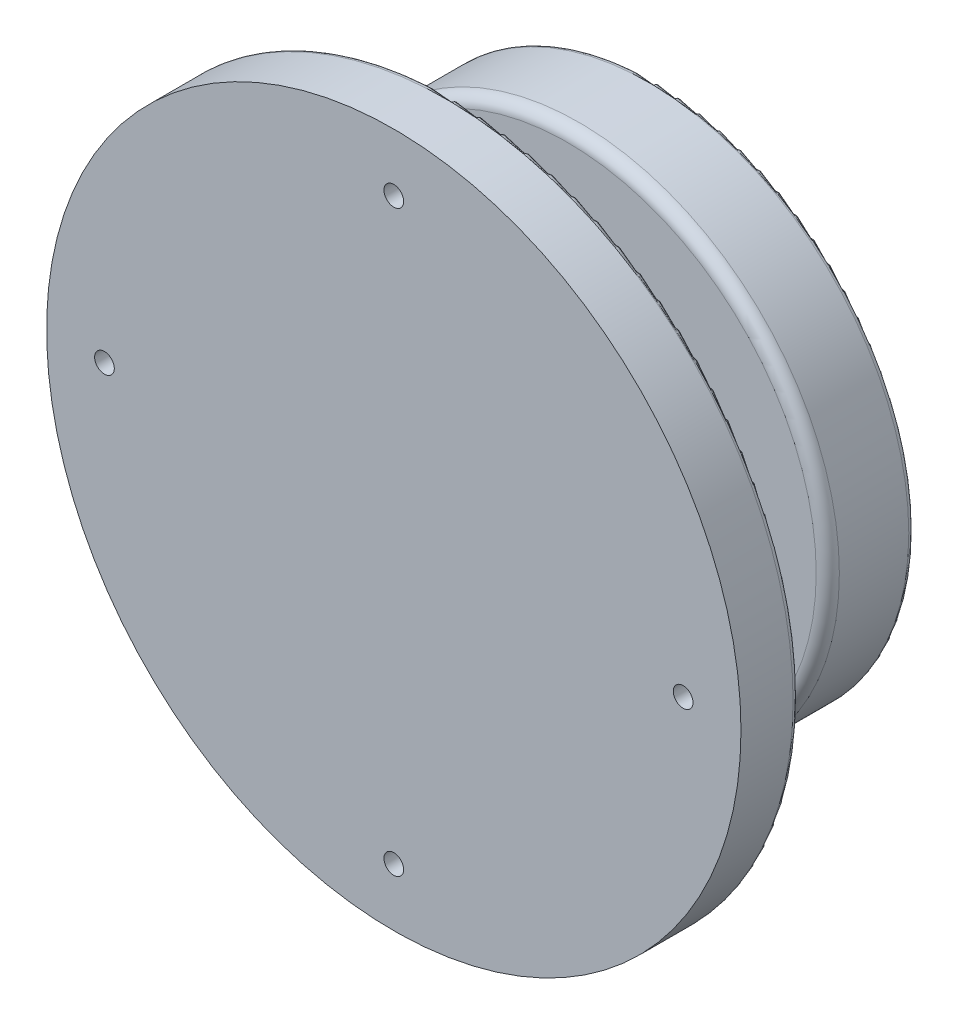
ISO-10303-21;
HEADER;
FILE_DESCRIPTION(('STEP AP214'),'2;1');
FILE_NAME('part.step','',(''),(''),'','','');
FILE_SCHEMA(('AUTOMOTIVE_DESIGN { 1 0 10303 214 1 1 1 1 }'));
ENDSEC;
DATA;
#1=APPLICATION_CONTEXT('core data for automotive mechanical design processes');
#2=APPLICATION_PROTOCOL_DEFINITION('international standard','automotive_design',2000,#1);
#3=PRODUCT_CONTEXT('',#1,'mechanical');
#4=PRODUCT('Part','Part','',(#3));
#5=PRODUCT_RELATED_PRODUCT_CATEGORY('part','',(#4));
#6=PRODUCT_DEFINITION_FORMATION('','',#4);
#7=PRODUCT_DEFINITION_CONTEXT('part definition',#1,'design');
#8=PRODUCT_DEFINITION('design','',#6,#7);
#9=PRODUCT_DEFINITION_SHAPE('','',#8);
#10=(LENGTH_UNIT() NAMED_UNIT(*) SI_UNIT(.MILLI.,.METRE.));
#11=(NAMED_UNIT(*) PLANE_ANGLE_UNIT() SI_UNIT($,.RADIAN.));
#12=(NAMED_UNIT(*) SI_UNIT($,.STERADIAN.) SOLID_ANGLE_UNIT());
#13=UNCERTAINTY_MEASURE_WITH_UNIT(LENGTH_MEASURE(1.E-05),#10,'distance_accuracy_value','');
#14=(GEOMETRIC_REPRESENTATION_CONTEXT(3) GLOBAL_UNCERTAINTY_ASSIGNED_CONTEXT((#13)) GLOBAL_UNIT_ASSIGNED_CONTEXT((#10,
#11,#12)) REPRESENTATION_CONTEXT('',''));
#15=CARTESIAN_POINT('',(0.,0.,0.));
#16=DIRECTION('',(0.,0.,1.));
#17=DIRECTION('',(1.,0.,0.));
#18=AXIS2_PLACEMENT_3D('',#15,#16,#17);
#19=CARTESIAN_POINT('',(0.,0.,15.));
#20=DIRECTION('',(0.,0.,1.));
#21=DIRECTION('',(1.,0.,0.));
#22=AXIS2_PLACEMENT_3D('',#19,#20,#21);
#23=PLANE('',#22);
#24=CARTESIAN_POINT('',(0.,0.,15.));
#25=DIRECTION('',(0.,0.,1.));
#26=DIRECTION('',(1.,0.,0.));
#27=AXIS2_PLACEMENT_3D('',#24,#25,#26);
#28=CIRCLE('',#27,43.);
#29=CARTESIAN_POINT('',(43.,0.,15.));
#30=VERTEX_POINT('',#29);
#31=EDGE_CURVE('E82',#30,#30,#28,.T.);
#32=ORIENTED_EDGE('',*,*,#31,.T.);
#33=EDGE_LOOP('',(#32));
#34=FACE_BOUND('',#33,.T.);
#35=CARTESIAN_POINT('',(0.,0.,15.));
#36=DIRECTION('',(0.,0.,1.));
#37=DIRECTION('',(1.,0.,0.));
#38=AXIS2_PLACEMENT_3D('',#35,#36,#37);
#39=CIRCLE('',#38,10.);
#40=CARTESIAN_POINT('',(10.,0.,15.));
#41=VERTEX_POINT('',#40);
#42=EDGE_CURVE('E78',#41,#41,#39,.T.);
#43=ORIENTED_EDGE('',*,*,#42,.F.);
#44=EDGE_LOOP('',(#43));
#45=FACE_BOUND('',#44,.T.);
#46=ADVANCED_FACE('F38',(#34,#45),#23,.T.);
#47=CARTESIAN_POINT('',(0.,0.,15.));
#48=DIRECTION('',(0.,0.,-1.));
#49=DIRECTION('',(-1.,0.,0.));
#50=AXIS2_PLACEMENT_3D('',#47,#48,#49);
#51=CYLINDRICAL_SURFACE('',#50,45.);
#52=CARTESIAN_POINT('',(0.,0.,1.));
#53=DIRECTION('',(0.,0.,1.));
#54=DIRECTION('',(1.,0.,0.));
#55=AXIS2_PLACEMENT_3D('',#52,#53,#54);
#56=CIRCLE('',#55,45.);
#57=CARTESIAN_POINT('',(45.,0.,1.));
#58=VERTEX_POINT('',#57);
#59=EDGE_CURVE('E46',#58,#58,#56,.T.);
#60=ORIENTED_EDGE('',*,*,#59,.T.);
#61=EDGE_LOOP('',(#60));
#62=FACE_BOUND('',#61,.T.);
#63=CARTESIAN_POINT('',(0.,0.,13.));
#64=DIRECTION('',(0.,0.,1.));
#65=DIRECTION('',(1.,0.,0.));
#66=AXIS2_PLACEMENT_3D('',#63,#64,#65);
#67=CIRCLE('',#66,45.);
#68=CARTESIAN_POINT('',(45.,0.,13.));
#69=VERTEX_POINT('',#68);
#70=EDGE_CURVE('E87',#69,#69,#67,.F.);
#71=ORIENTED_EDGE('',*,*,#70,.T.);
#72=EDGE_LOOP('',(#71));
#73=FACE_BOUND('',#72,.T.);
#74=ADVANCED_FACE('F98',(#62,#73),#51,.T.);
#75=CARTESIAN_POINT('',(0.,0.,0.));
#76=DIRECTION('',(0.,0.,1.));
#77=DIRECTION('',(1.,0.,0.));
#78=AXIS2_PLACEMENT_3D('',#75,#76,#77);
#79=PLANE('',#78);
#80=CARTESIAN_POINT('',(-7.,0.,0.));
#81=DIRECTION('',(0.,0.,-1.));
#82=DIRECTION('',(-1.,0.,0.));
#83=AXIS2_PLACEMENT_3D('',#80,#81,#82);
#84=CIRCLE('',#83,1.24999999999999);
#85=CARTESIAN_POINT('',(-8.24999999999999,0.,0.));
#86=VERTEX_POINT('',#85);
#87=EDGE_CURVE('E63',#86,#86,#84,.T.);
#88=ORIENTED_EDGE('',*,*,#87,.F.);
#89=EDGE_LOOP('',(#88));
#90=FACE_BOUND('',#89,.T.);
#91=CARTESIAN_POINT('',(7.,0.,0.));
#92=DIRECTION('',(0.,0.,-1.));
#93=DIRECTION('',(-1.,0.,0.));
#94=AXIS2_PLACEMENT_3D('',#91,#92,#93);
#95=CIRCLE('',#94,1.24999999999999);
#96=CARTESIAN_POINT('',(5.75000000000001,0.,0.));
#97=VERTEX_POINT('',#96);
#98=EDGE_CURVE('E62',#97,#97,#95,.T.);
#99=ORIENTED_EDGE('',*,*,#98,.F.);
#100=EDGE_LOOP('',(#99));
#101=FACE_BOUND('',#100,.T.);
#102=CARTESIAN_POINT('',(0.,0.,0.));
#103=DIRECTION('',(0.,0.,1.));
#104=DIRECTION('',(1.,0.,0.));
#105=AXIS2_PLACEMENT_3D('',#102,#103,#104);
#106=CIRCLE('',#105,44.);
#107=CARTESIAN_POINT('',(44.,0.,0.));
#108=VERTEX_POINT('',#107);
#109=EDGE_CURVE('E11',#108,#108,#106,.F.);
#110=ORIENTED_EDGE('',*,*,#109,.T.);
#111=EDGE_LOOP('',(#110));
#112=FACE_BOUND('',#111,.T.);
#113=ADVANCED_FACE('F119',(#90,#101,#112),#79,.F.);
#114=CARTESIAN_POINT('',(0.,0.,35.));
#115=DIRECTION('',(0.,0.,-1.));
#116=DIRECTION('',(-1.,0.,0.));
#117=AXIS2_PLACEMENT_3D('',#114,#115,#116);
#118=CYLINDRICAL_SURFACE('',#117,10.);
#119=CARTESIAN_POINT('',(0.,0.,35.));
#120=DIRECTION('',(0.,0.,1.));
#121=DIRECTION('',(1.,0.,0.));
#122=AXIS2_PLACEMENT_3D('',#119,#120,#121);
#123=CIRCLE('',#122,10.);
#124=CARTESIAN_POINT('',(10.,0.,35.));
#125=VERTEX_POINT('',#124);
#126=EDGE_CURVE('E79',#125,#125,#123,.T.);
#127=ORIENTED_EDGE('',*,*,#126,.F.);
#128=EDGE_LOOP('',(#127));
#129=FACE_BOUND('',#128,.T.);
#130=ORIENTED_EDGE('',*,*,#42,.T.);
#131=EDGE_LOOP('',(#130));
#132=FACE_BOUND('',#131,.T.);
#133=ADVANCED_FACE('F124',(#129,#132),#118,.T.);
#134=CARTESIAN_POINT('',(0.,0.,35.));
#135=DIRECTION('',(0.,0.,1.));
#136=DIRECTION('',(1.,0.,0.));
#137=AXIS2_PLACEMENT_3D('',#134,#135,#136);
#138=PLANE('',#137);
#139=CARTESIAN_POINT('',(0.,50.,35.));
#140=DIRECTION('',(0.,0.,-1.));
#141=DIRECTION('',(-1.,0.,0.));
#142=AXIS2_PLACEMENT_3D('',#139,#140,#141);
#143=CIRCLE('',#142,4.7005);
#144=CARTESIAN_POINT('',(-4.7005,50.,35.));
#145=VERTEX_POINT('',#144);
#146=EDGE_CURVE('E159',#145,#145,#143,.T.);
#147=ORIENTED_EDGE('',*,*,#146,.F.);
#148=EDGE_LOOP('',(#147));
#149=FACE_BOUND('',#148,.T.);
#150=CARTESIAN_POINT('',(50.,0.,35.));
#151=DIRECTION('',(0.,0.,-1.));
#152=DIRECTION('',(-1.,0.,0.));
#153=AXIS2_PLACEMENT_3D('',#150,#151,#152);
#154=CIRCLE('',#153,4.7005);
#155=CARTESIAN_POINT('',(45.2995,0.,35.));
#156=VERTEX_POINT('',#155);
#157=EDGE_CURVE('E163',#156,#156,#154,.T.);
#158=ORIENTED_EDGE('',*,*,#157,.F.);
#159=EDGE_LOOP('',(#158));
#160=FACE_BOUND('',#159,.T.);
#161=CARTESIAN_POINT('',(0.,-50.,35.));
#162=DIRECTION('',(0.,0.,-1.));
#163=DIRECTION('',(-1.,0.,0.));
#164=AXIS2_PLACEMENT_3D('',#161,#162,#163);
#165=CIRCLE('',#164,4.7005);
#166=CARTESIAN_POINT('',(-4.7005,-50.,35.));
#167=VERTEX_POINT('',#166);
#168=EDGE_CURVE('E167',#167,#167,#165,.T.);
#169=ORIENTED_EDGE('',*,*,#168,.F.);
#170=EDGE_LOOP('',(#169));
#171=FACE_BOUND('',#170,.T.);
#172=CARTESIAN_POINT('',(-50.,0.,35.));
#173=DIRECTION('',(0.,0.,-1.));
#174=DIRECTION('',(-1.,0.,0.));
#175=AXIS2_PLACEMENT_3D('',#172,#173,#174);
#176=CIRCLE('',#175,4.7005);
#177=CARTESIAN_POINT('',(-54.7005,0.,35.));
#178=VERTEX_POINT('',#177);
#179=EDGE_CURVE('E171',#178,#178,#176,.T.);
#180=ORIENTED_EDGE('',*,*,#179,.F.);
#181=EDGE_LOOP('',(#180));
#182=FACE_BOUND('',#181,.T.);
#183=CARTESIAN_POINT('',(0.,0.,35.));
#184=DIRECTION('',(0.,0.,1.));
#185=DIRECTION('',(1.,0.,0.));
#186=AXIS2_PLACEMENT_3D('',#183,#184,#185);
#187=CIRCLE('',#186,59.);
#188=CARTESIAN_POINT('',(59.,0.,35.));
#189=VERTEX_POINT('',#188);
#190=EDGE_CURVE('E93',#189,#189,#187,.F.);
#191=ORIENTED_EDGE('',*,*,#190,.T.);
#192=EDGE_LOOP('',(#191));
#193=FACE_BOUND('',#192,.T.);
#194=ORIENTED_EDGE('',*,*,#126,.T.);
#195=EDGE_LOOP('',(#194));
#196=FACE_BOUND('',#195,.T.);
#197=ADVANCED_FACE('F144',(#149,#160,#171,#182,#193,#196),#138,.F.);
#198=CARTESIAN_POINT('',(0.,0.,45.));
#199=DIRECTION('',(0.,0.,-1.));
#200=DIRECTION('',(-1.,0.,0.));
#201=AXIS2_PLACEMENT_3D('',#198,#199,#200);
#202=CYLINDRICAL_SURFACE('',#201,60.);
#203=CARTESIAN_POINT('',(0.,0.,36.));
#204=DIRECTION('',(0.,0.,1.));
#205=DIRECTION('',(1.,0.,0.));
#206=AXIS2_PLACEMENT_3D('',#203,#204,#205);
#207=CIRCLE('',#206,60.);
#208=CARTESIAN_POINT('',(60.,0.,36.));
#209=VERTEX_POINT('',#208);
#210=EDGE_CURVE('E90',#209,#209,#207,.T.);
#211=ORIENTED_EDGE('',*,*,#210,.T.);
#212=EDGE_LOOP('',(#211));
#213=FACE_BOUND('',#212,.T.);
#214=CARTESIAN_POINT('',(0.,0.,45.));
#215=DIRECTION('',(0.,0.,1.));
#216=DIRECTION('',(1.,0.,0.));
#217=AXIS2_PLACEMENT_3D('',#214,#215,#216);
#218=CIRCLE('',#217,60.);
#219=CARTESIAN_POINT('',(60.,0.,45.));
#220=VERTEX_POINT('',#219);
#221=EDGE_CURVE('E75',#220,#220,#218,.T.);
#222=ORIENTED_EDGE('',*,*,#221,.F.);
#223=EDGE_LOOP('',(#222));
#224=FACE_BOUND('',#223,.T.);
#225=ADVANCED_FACE('F135',(#213,#224),#202,.T.);
#226=CARTESIAN_POINT('',(0.,0.,45.));
#227=DIRECTION('',(0.,0.,1.));
#228=DIRECTION('',(1.,0.,0.));
#229=AXIS2_PLACEMENT_3D('',#226,#227,#228);
#230=PLANE('',#229);
#231=CARTESIAN_POINT('',(0.,50.,45.));
#232=DIRECTION('',(0.,0.,-1.));
#233=DIRECTION('',(-1.,0.,0.));
#234=AXIS2_PLACEMENT_3D('',#231,#232,#233);
#235=CIRCLE('',#234,1.7);
#236=CARTESIAN_POINT('',(-1.7,50.,45.));
#237=VERTEX_POINT('',#236);
#238=EDGE_CURVE('E402',#237,#237,#235,.T.);
#239=ORIENTED_EDGE('',*,*,#238,.T.);
#240=EDGE_LOOP('',(#239));
#241=FACE_BOUND('',#240,.T.);
#242=CARTESIAN_POINT('',(50.,0.,45.));
#243=DIRECTION('',(0.,0.,-1.));
#244=DIRECTION('',(-1.,0.,0.));
#245=AXIS2_PLACEMENT_3D('',#242,#243,#244);
#246=CIRCLE('',#245,1.7);
#247=CARTESIAN_POINT('',(48.3,0.,45.));
#248=VERTEX_POINT('',#247);
#249=EDGE_CURVE('E414',#248,#248,#246,.T.);
#250=ORIENTED_EDGE('',*,*,#249,.T.);
#251=EDGE_LOOP('',(#250));
#252=FACE_BOUND('',#251,.T.);
#253=CARTESIAN_POINT('',(0.,-50.,45.));
#254=DIRECTION('',(0.,0.,-1.));
#255=DIRECTION('',(-1.,0.,0.));
#256=AXIS2_PLACEMENT_3D('',#253,#254,#255);
#257=CIRCLE('',#256,1.7);
#258=CARTESIAN_POINT('',(-1.7,-50.,45.));
#259=VERTEX_POINT('',#258);
#260=EDGE_CURVE('E184',#259,#259,#257,.T.);
#261=ORIENTED_EDGE('',*,*,#260,.T.);
#262=EDGE_LOOP('',(#261));
#263=FACE_BOUND('',#262,.T.);
#264=CARTESIAN_POINT('',(-50.,0.,45.));
#265=DIRECTION('',(0.,0.,-1.));
#266=DIRECTION('',(-1.,0.,0.));
#267=AXIS2_PLACEMENT_3D('',#264,#265,#266);
#268=CIRCLE('',#267,1.7);
#269=CARTESIAN_POINT('',(-51.7,0.,45.));
#270=VERTEX_POINT('',#269);
#271=EDGE_CURVE('E69',#270,#270,#268,.T.);
#272=ORIENTED_EDGE('',*,*,#271,.T.);
#273=EDGE_LOOP('',(#272));
#274=FACE_BOUND('',#273,.T.);
#275=ORIENTED_EDGE('',*,*,#221,.T.);
#276=EDGE_LOOP('',(#275));
#277=FACE_BOUND('',#276,.T.);
#278=ADVANCED_FACE('F130',(#241,#252,#263,#274,#277),#230,.T.);
#279=CARTESIAN_POINT('',(0.,0.,13.));
#280=DIRECTION('',(0.,0.,1.));
#281=DIRECTION('',(1.,0.,0.));
#282=AXIS2_PLACEMENT_3D('',#279,#280,#281);
#283=TOROIDAL_SURFACE('',#282,43.,2.);
#284=ORIENTED_EDGE('',*,*,#70,.F.);
#285=EDGE_LOOP('',(#284));
#286=FACE_BOUND('',#285,.T.);
#287=ORIENTED_EDGE('',*,*,#31,.F.);
#288=EDGE_LOOP('',(#287));
#289=FACE_BOUND('',#288,.T.);
#290=ADVANCED_FACE('F110',(#286,#289),#283,.T.);
#291=CARTESIAN_POINT('',(0.,0.,36.));
#292=DIRECTION('',(0.,0.,1.));
#293=DIRECTION('',(1.,0.,0.));
#294=AXIS2_PLACEMENT_3D('',#291,#292,#293);
#295=TOROIDAL_SURFACE('',#294,59.,1.);
#296=ORIENTED_EDGE('',*,*,#190,.F.);
#297=EDGE_LOOP('',(#296));
#298=FACE_BOUND('',#297,.T.);
#299=ORIENTED_EDGE('',*,*,#210,.F.);
#300=EDGE_LOOP('',(#299));
#301=FACE_BOUND('',#300,.T.);
#302=ADVANCED_FACE('F103',(#298,#301),#295,.T.);
#303=CARTESIAN_POINT('',(0.,0.,1.));
#304=DIRECTION('',(0.,0.,1.));
#305=DIRECTION('',(1.,0.,0.));
#306=AXIS2_PLACEMENT_3D('',#303,#304,#305);
#307=TOROIDAL_SURFACE('',#306,44.,1.);
#308=ORIENTED_EDGE('',*,*,#109,.F.);
#309=EDGE_LOOP('',(#308));
#310=FACE_BOUND('',#309,.T.);
#311=ORIENTED_EDGE('',*,*,#59,.F.);
#312=EDGE_LOOP('',(#311));
#313=FACE_BOUND('',#312,.T.);
#314=ADVANCED_FACE('F40',(#310,#313),#307,.T.);
#315=CARTESIAN_POINT('',(7.,0.,12.5));
#316=DIRECTION('',(0.,0.,-1.));
#317=DIRECTION('',(-1.,0.,0.));
#318=AXIS2_PLACEMENT_3D('',#315,#316,#317);
#319=CONICAL_SURFACE('',#318,1.24999999999999,1.02974425867665);
#320=CARTESIAN_POINT('',(7.,0.,13.2510757737845));
#321=VERTEX_POINT('',#320);
#322=VERTEX_LOOP('',#321);
#323=FACE_BOUND('',#322,.T.);
#324=CARTESIAN_POINT('',(7.,0.,12.5));
#325=DIRECTION('',(0.,0.,-1.));
#326=DIRECTION('',(-1.,0.,0.));
#327=AXIS2_PLACEMENT_3D('',#324,#325,#326);
#328=CIRCLE('',#327,1.24999999999999);
#329=CARTESIAN_POINT('',(5.75000000000001,0.,12.5));
#330=VERTEX_POINT('',#329);
#331=EDGE_CURVE('E66',#330,#330,#328,.T.);
#332=ORIENTED_EDGE('',*,*,#331,.T.);
#333=EDGE_LOOP('',(#332));
#334=FACE_BOUND('',#333,.T.);
#335=ADVANCED_FACE('F102',(#323,#334),#319,.F.);
#336=CARTESIAN_POINT('',(7.,0.,0.));
#337=DIRECTION('',(0.,0.,-1.));
#338=DIRECTION('',(-1.,0.,0.));
#339=AXIS2_PLACEMENT_3D('',#336,#337,#338);
#340=CYLINDRICAL_SURFACE('',#339,1.24999999999999);
#341=ORIENTED_EDGE('',*,*,#331,.F.);
#342=EDGE_LOOP('',(#341));
#343=FACE_BOUND('',#342,.T.);
#344=ORIENTED_EDGE('',*,*,#98,.T.);
#345=EDGE_LOOP('',(#344));
#346=FACE_BOUND('',#345,.T.);
#347=ADVANCED_FACE('F56',(#343,#346),#340,.F.);
#348=CARTESIAN_POINT('',(-7.,0.,12.5));
#349=DIRECTION('',(0.,0.,-1.));
#350=DIRECTION('',(-1.,0.,0.));
#351=AXIS2_PLACEMENT_3D('',#348,#349,#350);
#352=CONICAL_SURFACE('',#351,1.24999999999999,1.02974425867665);
#353=CARTESIAN_POINT('',(-7.,0.,13.2510757737845));
#354=VERTEX_POINT('',#353);
#355=VERTEX_LOOP('',#354);
#356=FACE_BOUND('',#355,.T.);
#357=CARTESIAN_POINT('',(-7.,0.,12.5));
#358=DIRECTION('',(0.,0.,-1.));
#359=DIRECTION('',(-1.,0.,0.));
#360=AXIS2_PLACEMENT_3D('',#357,#358,#359);
#361=CIRCLE('',#360,1.24999999999999);
#362=CARTESIAN_POINT('',(-8.24999999999999,0.,12.5));
#363=VERTEX_POINT('',#362);
#364=EDGE_CURVE('E60',#363,#363,#361,.T.);
#365=ORIENTED_EDGE('',*,*,#364,.T.);
#366=EDGE_LOOP('',(#365));
#367=FACE_BOUND('',#366,.T.);
#368=ADVANCED_FACE('F52',(#356,#367),#352,.F.);
#369=CARTESIAN_POINT('',(-7.,0.,0.));
#370=DIRECTION('',(0.,0.,-1.));
#371=DIRECTION('',(-1.,0.,0.));
#372=AXIS2_PLACEMENT_3D('',#369,#370,#371);
#373=CYLINDRICAL_SURFACE('',#372,1.24999999999999);
#374=ORIENTED_EDGE('',*,*,#364,.F.);
#375=EDGE_LOOP('',(#374));
#376=FACE_BOUND('',#375,.T.);
#377=ORIENTED_EDGE('',*,*,#87,.T.);
#378=EDGE_LOOP('',(#377));
#379=FACE_BOUND('',#378,.T.);
#380=ADVANCED_FACE('F55',(#376,#379),#373,.F.);
#381=CARTESIAN_POINT('',(-50.,0.,35.));
#382=DIRECTION('',(0.,0.,-1.));
#383=DIRECTION('',(-1.,0.,0.));
#384=AXIS2_PLACEMENT_3D('',#381,#382,#383);
#385=CYLINDRICAL_SURFACE('',#384,1.7);
#386=ORIENTED_EDGE('',*,*,#271,.F.);
#387=EDGE_LOOP('',(#386));
#388=FACE_BOUND('',#387,.T.);
#389=CARTESIAN_POINT('',(-50.,0.,40.));
#390=DIRECTION('',(0.,0.,-1.));
#391=DIRECTION('',(-1.,0.,0.));
#392=AXIS2_PLACEMENT_3D('',#389,#390,#391);
#393=CIRCLE('',#392,1.7);
#394=CARTESIAN_POINT('',(-51.7,0.,40.));
#395=VERTEX_POINT('',#394);
#396=EDGE_CURVE('E196',#395,#395,#393,.T.);
#397=ORIENTED_EDGE('',*,*,#396,.T.);
#398=EDGE_LOOP('',(#397));
#399=FACE_BOUND('',#398,.T.);
#400=ADVANCED_FACE('F202',(#388,#399),#385,.F.);
#401=CARTESIAN_POINT('',(-45.3245,0.,40.));
#402=DIRECTION('',(0.,0.,1.));
#403=DIRECTION('',(1.,0.,0.));
#404=AXIS2_PLACEMENT_3D('',#401,#402,#403);
#405=PLANE('',#404);
#406=ORIENTED_EDGE('',*,*,#396,.F.);
#407=EDGE_LOOP('',(#406));
#408=FACE_BOUND('',#407,.T.);
#409=CARTESIAN_POINT('',(-50.,0.,40.));
#410=DIRECTION('',(0.,0.,-1.));
#411=DIRECTION('',(-1.,0.,0.));
#412=AXIS2_PLACEMENT_3D('',#409,#410,#411);
#413=CIRCLE('',#412,4.6755);
#414=CARTESIAN_POINT('',(-54.6755,0.,40.));
#415=VERTEX_POINT('',#414);
#416=EDGE_CURVE('E187',#415,#415,#413,.T.);
#417=ORIENTED_EDGE('',*,*,#416,.T.);
#418=EDGE_LOOP('',(#417));
#419=FACE_BOUND('',#418,.T.);
#420=ADVANCED_FACE('F205',(#408,#419),#405,.F.);
#421=CARTESIAN_POINT('',(-50.,0.,35.));
#422=DIRECTION('',(0.,0.,-1.));
#423=DIRECTION('',(-1.,0.,0.));
#424=AXIS2_PLACEMENT_3D('',#421,#422,#423);
#425=CYLINDRICAL_SURFACE('',#424,4.6755);
#426=ORIENTED_EDGE('',*,*,#416,.F.);
#427=EDGE_LOOP('',(#426));
#428=FACE_BOUND('',#427,.T.);
#429=CARTESIAN_POINT('',(-50.,0.,35.025));
#430=DIRECTION('',(0.,0.,-1.));
#431=DIRECTION('',(-1.,0.,0.));
#432=AXIS2_PLACEMENT_3D('',#429,#430,#431);
#433=CIRCLE('',#432,4.6755);
#434=CARTESIAN_POINT('',(-54.6755,0.,35.025));
#435=VERTEX_POINT('',#434);
#436=EDGE_CURVE('E183',#435,#435,#433,.T.);
#437=ORIENTED_EDGE('',*,*,#436,.T.);
#438=EDGE_LOOP('',(#437));
#439=FACE_BOUND('',#438,.T.);
#440=ADVANCED_FACE('F211',(#428,#439),#425,.F.);
#441=CARTESIAN_POINT('',(-50.,0.,35.));
#442=DIRECTION('',(0.,0.,-1.));
#443=DIRECTION('',(-1.,0.,0.));
#444=AXIS2_PLACEMENT_3D('',#441,#442,#443);
#445=CONICAL_SURFACE('',#444,4.7005,0.785398163397587);
#446=ORIENTED_EDGE('',*,*,#436,.F.);
#447=EDGE_LOOP('',(#446));
#448=FACE_BOUND('',#447,.T.);
#449=ORIENTED_EDGE('',*,*,#179,.T.);
#450=EDGE_LOOP('',(#449));
#451=FACE_BOUND('',#450,.T.);
#452=ADVANCED_FACE('F217',(#448,#451),#445,.F.);
#453=CARTESIAN_POINT('',(0.,-50.,35.));
#454=DIRECTION('',(0.,0.,-1.));
#455=DIRECTION('',(-1.,0.,0.));
#456=AXIS2_PLACEMENT_3D('',#453,#454,#455);
#457=CYLINDRICAL_SURFACE('',#456,1.7);
#458=ORIENTED_EDGE('',*,*,#260,.F.);
#459=EDGE_LOOP('',(#458));
#460=FACE_BOUND('',#459,.T.);
#461=CARTESIAN_POINT('',(0.,-50.,40.));
#462=DIRECTION('',(0.,0.,-1.));
#463=DIRECTION('',(-1.,0.,0.));
#464=AXIS2_PLACEMENT_3D('',#461,#462,#463);
#465=CIRCLE('',#464,1.7);
#466=CARTESIAN_POINT('',(-1.7,-50.,40.));
#467=VERTEX_POINT('',#466);
#468=EDGE_CURVE('E190',#467,#467,#465,.T.);
#469=ORIENTED_EDGE('',*,*,#468,.T.);
#470=EDGE_LOOP('',(#469));
#471=FACE_BOUND('',#470,.T.);
#472=ADVANCED_FACE('F222',(#460,#471),#457,.F.);
#473=CARTESIAN_POINT('',(4.6755,-50.,40.));
#474=DIRECTION('',(0.,0.,1.));
#475=DIRECTION('',(1.,0.,0.));
#476=AXIS2_PLACEMENT_3D('',#473,#474,#475);
#477=PLANE('',#476);
#478=ORIENTED_EDGE('',*,*,#468,.F.);
#479=EDGE_LOOP('',(#478));
#480=FACE_BOUND('',#479,.T.);
#481=CARTESIAN_POINT('',(0.,-50.,40.));
#482=DIRECTION('',(0.,0.,-1.));
#483=DIRECTION('',(-1.,0.,0.));
#484=AXIS2_PLACEMENT_3D('',#481,#482,#483);
#485=CIRCLE('',#484,4.6755);
#486=CARTESIAN_POINT('',(-4.6755,-50.,40.));
#487=VERTEX_POINT('',#486);
#488=EDGE_CURVE('E421',#487,#487,#485,.T.);
#489=ORIENTED_EDGE('',*,*,#488,.T.);
#490=EDGE_LOOP('',(#489));
#491=FACE_BOUND('',#490,.T.);
#492=ADVANCED_FACE('F227',(#480,#491),#477,.F.);
#493=CARTESIAN_POINT('',(0.,-50.,35.));
#494=DIRECTION('',(0.,0.,-1.));
#495=DIRECTION('',(-1.,0.,0.));
#496=AXIS2_PLACEMENT_3D('',#493,#494,#495);
#497=CYLINDRICAL_SURFACE('',#496,4.6755);
#498=ORIENTED_EDGE('',*,*,#488,.F.);
#499=EDGE_LOOP('',(#498));
#500=FACE_BOUND('',#499,.T.);
#501=CARTESIAN_POINT('',(0.,-50.,35.025));
#502=DIRECTION('',(0.,0.,-1.));
#503=DIRECTION('',(-1.,0.,0.));
#504=AXIS2_PLACEMENT_3D('',#501,#502,#503);
#505=CIRCLE('',#504,4.6755);
#506=CARTESIAN_POINT('',(-4.6755,-50.,35.025));
#507=VERTEX_POINT('',#506);
#508=EDGE_CURVE('E418',#507,#507,#505,.T.);
#509=ORIENTED_EDGE('',*,*,#508,.T.);
#510=EDGE_LOOP('',(#509));
#511=FACE_BOUND('',#510,.T.);
#512=ADVANCED_FACE('F286',(#500,#511),#497,.F.);
#513=CARTESIAN_POINT('',(0.,-50.,35.));
#514=DIRECTION('',(0.,0.,-1.));
#515=DIRECTION('',(-1.,0.,0.));
#516=AXIS2_PLACEMENT_3D('',#513,#514,#515);
#517=CONICAL_SURFACE('',#516,4.7005,0.785398163397726);
#518=ORIENTED_EDGE('',*,*,#508,.F.);
#519=EDGE_LOOP('',(#518));
#520=FACE_BOUND('',#519,.T.);
#521=ORIENTED_EDGE('',*,*,#168,.T.);
#522=EDGE_LOOP('',(#521));
#523=FACE_BOUND('',#522,.T.);
#524=ADVANCED_FACE('F295',(#520,#523),#517,.F.);
#525=CARTESIAN_POINT('',(50.,0.,35.));
#526=DIRECTION('',(0.,0.,-1.));
#527=DIRECTION('',(-1.,0.,0.));
#528=AXIS2_PLACEMENT_3D('',#525,#526,#527);
#529=CYLINDRICAL_SURFACE('',#528,1.7);
#530=ORIENTED_EDGE('',*,*,#249,.F.);
#531=EDGE_LOOP('',(#530));
#532=FACE_BOUND('',#531,.T.);
#533=CARTESIAN_POINT('',(50.,0.,40.));
#534=DIRECTION('',(0.,0.,-1.));
#535=DIRECTION('',(-1.,0.,0.));
#536=AXIS2_PLACEMENT_3D('',#533,#534,#535);
#537=CIRCLE('',#536,1.7);
#538=CARTESIAN_POINT('',(48.3,0.,40.));
#539=VERTEX_POINT('',#538);
#540=EDGE_CURVE('E411',#539,#539,#537,.T.);
#541=ORIENTED_EDGE('',*,*,#540,.T.);
#542=EDGE_LOOP('',(#541));
#543=FACE_BOUND('',#542,.T.);
#544=ADVANCED_FACE('F305',(#532,#543),#529,.F.);
#545=CARTESIAN_POINT('',(54.6755,0.,40.));
#546=DIRECTION('',(0.,0.,1.));
#547=DIRECTION('',(1.,0.,0.));
#548=AXIS2_PLACEMENT_3D('',#545,#546,#547);
#549=PLANE('',#548);
#550=ORIENTED_EDGE('',*,*,#540,.F.);
#551=EDGE_LOOP('',(#550));
#552=FACE_BOUND('',#551,.T.);
#553=CARTESIAN_POINT('',(50.,0.,40.));
#554=DIRECTION('',(0.,0.,-1.));
#555=DIRECTION('',(-1.,0.,0.));
#556=AXIS2_PLACEMENT_3D('',#553,#554,#555);
#557=CIRCLE('',#556,4.6755);
#558=CARTESIAN_POINT('',(45.3245,0.,40.));
#559=VERTEX_POINT('',#558);
#560=EDGE_CURVE('E408',#559,#559,#557,.T.);
#561=ORIENTED_EDGE('',*,*,#560,.T.);
#562=EDGE_LOOP('',(#561));
#563=FACE_BOUND('',#562,.T.);
#564=ADVANCED_FACE('F315',(#552,#563),#549,.F.);
#565=CARTESIAN_POINT('',(50.,0.,35.));
#566=DIRECTION('',(0.,0.,-1.));
#567=DIRECTION('',(-1.,0.,0.));
#568=AXIS2_PLACEMENT_3D('',#565,#566,#567);
#569=CYLINDRICAL_SURFACE('',#568,4.6755);
#570=ORIENTED_EDGE('',*,*,#560,.F.);
#571=EDGE_LOOP('',(#570));
#572=FACE_BOUND('',#571,.T.);
#573=CARTESIAN_POINT('',(50.,0.,35.025));
#574=DIRECTION('',(0.,0.,-1.));
#575=DIRECTION('',(-1.,0.,0.));
#576=AXIS2_PLACEMENT_3D('',#573,#574,#575);
#577=CIRCLE('',#576,4.6755);
#578=CARTESIAN_POINT('',(45.3245,0.,35.025));
#579=VERTEX_POINT('',#578);
#580=EDGE_CURVE('E405',#579,#579,#577,.T.);
#581=ORIENTED_EDGE('',*,*,#580,.T.);
#582=EDGE_LOOP('',(#581));
#583=FACE_BOUND('',#582,.T.);
#584=ADVANCED_FACE('F325',(#572,#583),#569,.F.);
#585=CARTESIAN_POINT('',(50.,0.,35.));
#586=DIRECTION('',(0.,0.,-1.));
#587=DIRECTION('',(-1.,0.,0.));
#588=AXIS2_PLACEMENT_3D('',#585,#586,#587);
#589=CONICAL_SURFACE('',#588,4.7005,0.785398163397587);
#590=ORIENTED_EDGE('',*,*,#580,.F.);
#591=EDGE_LOOP('',(#590));
#592=FACE_BOUND('',#591,.T.);
#593=ORIENTED_EDGE('',*,*,#157,.T.);
#594=EDGE_LOOP('',(#593));
#595=FACE_BOUND('',#594,.T.);
#596=ADVANCED_FACE('F335',(#592,#595),#589,.F.);
#597=CARTESIAN_POINT('',(0.,50.,35.));
#598=DIRECTION('',(0.,0.,-1.));
#599=DIRECTION('',(-1.,0.,0.));
#600=AXIS2_PLACEMENT_3D('',#597,#598,#599);
#601=CYLINDRICAL_SURFACE('',#600,1.7);
#602=ORIENTED_EDGE('',*,*,#238,.F.);
#603=EDGE_LOOP('',(#602));
#604=FACE_BOUND('',#603,.T.);
#605=CARTESIAN_POINT('',(0.,50.,40.));
#606=DIRECTION('',(0.,0.,-1.));
#607=DIRECTION('',(-1.,0.,0.));
#608=AXIS2_PLACEMENT_3D('',#605,#606,#607);
#609=CIRCLE('',#608,1.7);
#610=CARTESIAN_POINT('',(-1.7,50.,40.));
#611=VERTEX_POINT('',#610);
#612=EDGE_CURVE('E399',#611,#611,#609,.T.);
#613=ORIENTED_EDGE('',*,*,#612,.T.);
#614=EDGE_LOOP('',(#613));
#615=FACE_BOUND('',#614,.T.);
#616=ADVANCED_FACE('F345',(#604,#615),#601,.F.);
#617=CARTESIAN_POINT('',(4.6755,50.,40.));
#618=DIRECTION('',(0.,0.,1.));
#619=DIRECTION('',(1.,0.,0.));
#620=AXIS2_PLACEMENT_3D('',#617,#618,#619);
#621=PLANE('',#620);
#622=ORIENTED_EDGE('',*,*,#612,.F.);
#623=EDGE_LOOP('',(#622));
#624=FACE_BOUND('',#623,.T.);
#625=CARTESIAN_POINT('',(0.,50.,40.));
#626=DIRECTION('',(0.,0.,-1.));
#627=DIRECTION('',(-1.,0.,0.));
#628=AXIS2_PLACEMENT_3D('',#625,#626,#627);
#629=CIRCLE('',#628,4.6755);
#630=CARTESIAN_POINT('',(-4.6755,50.,40.));
#631=VERTEX_POINT('',#630);
#632=EDGE_CURVE('E394',#631,#631,#629,.T.);
#633=ORIENTED_EDGE('',*,*,#632,.T.);
#634=EDGE_LOOP('',(#633));
#635=FACE_BOUND('',#634,.T.);
#636=ADVANCED_FACE('F355',(#624,#635),#621,.F.);
#637=CARTESIAN_POINT('',(0.,50.,35.));
#638=DIRECTION('',(0.,0.,-1.));
#639=DIRECTION('',(-1.,0.,0.));
#640=AXIS2_PLACEMENT_3D('',#637,#638,#639);
#641=CYLINDRICAL_SURFACE('',#640,4.6755);
#642=ORIENTED_EDGE('',*,*,#632,.F.);
#643=EDGE_LOOP('',(#642));
#644=FACE_BOUND('',#643,.T.);
#645=CARTESIAN_POINT('',(0.,50.,35.025));
#646=DIRECTION('',(0.,0.,-1.));
#647=DIRECTION('',(-1.,0.,0.));
#648=AXIS2_PLACEMENT_3D('',#645,#646,#647);
#649=CIRCLE('',#648,4.6755);
#650=CARTESIAN_POINT('',(-4.6755,50.,35.025));
#651=VERTEX_POINT('',#650);
#652=EDGE_CURVE('E392',#651,#651,#649,.T.);
#653=ORIENTED_EDGE('',*,*,#652,.T.);
#654=EDGE_LOOP('',(#653));
#655=FACE_BOUND('',#654,.T.);
#656=ADVANCED_FACE('F365',(#644,#655),#641,.F.);
#657=CARTESIAN_POINT('',(0.,50.,35.));
#658=DIRECTION('',(0.,0.,-1.));
#659=DIRECTION('',(-1.,0.,0.));
#660=AXIS2_PLACEMENT_3D('',#657,#658,#659);
#661=CONICAL_SURFACE('',#660,4.7005,0.785398163397726);
#662=ORIENTED_EDGE('',*,*,#652,.F.);
#663=EDGE_LOOP('',(#662));
#664=FACE_BOUND('',#663,.T.);
#665=ORIENTED_EDGE('',*,*,#146,.T.);
#666=EDGE_LOOP('',(#665));
#667=FACE_BOUND('',#666,.T.);
#668=ADVANCED_FACE('F375',(#664,#667),#661,.F.);
#669=CLOSED_SHELL('',(#46,#74,#113,#133,#197,#225,#278,#290,#302,#314,#335,#347,#368,#380,#400,
#420,#440,#452,#472,#492,#512,#524,#544,#564,#584,#596,#616,#636,#656,#668));
#670=MANIFOLD_SOLID_BREP('B2',#669);
#671=ADVANCED_BREP_SHAPE_REPRESENTATION('',(#18,#670),#14);
#672=SHAPE_DEFINITION_REPRESENTATION(#9,#671);
ENDSEC;
END-ISO-10303-21;
